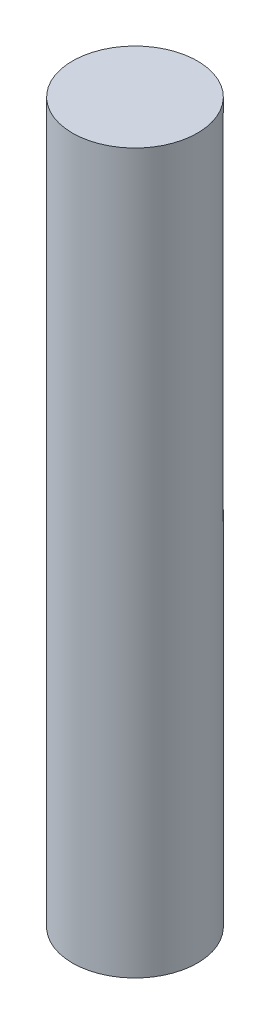
ISO-10303-21;
HEADER;
FILE_DESCRIPTION(('STEP AP214'),'2;1');
FILE_NAME('part.step','',(''),(''),'','','');
FILE_SCHEMA(('AUTOMOTIVE_DESIGN { 1 0 10303 214 1 1 1 1 }'));
ENDSEC;
DATA;
#1=APPLICATION_CONTEXT('core data for automotive mechanical design processes');
#2=APPLICATION_PROTOCOL_DEFINITION('international standard','automotive_design',2000,#1);
#3=PRODUCT_CONTEXT('',#1,'mechanical');
#4=PRODUCT('Part','Part','',(#3));
#5=PRODUCT_RELATED_PRODUCT_CATEGORY('part','',(#4));
#6=PRODUCT_DEFINITION_FORMATION('','',#4);
#7=PRODUCT_DEFINITION_CONTEXT('part definition',#1,'design');
#8=PRODUCT_DEFINITION('design','',#6,#7);
#9=PRODUCT_DEFINITION_SHAPE('','',#8);
#10=(LENGTH_UNIT() NAMED_UNIT(*) SI_UNIT(.MILLI.,.METRE.));
#11=(NAMED_UNIT(*) PLANE_ANGLE_UNIT() SI_UNIT($,.RADIAN.));
#12=(NAMED_UNIT(*) SI_UNIT($,.STERADIAN.) SOLID_ANGLE_UNIT());
#13=UNCERTAINTY_MEASURE_WITH_UNIT(LENGTH_MEASURE(1.E-05),#10,'distance_accuracy_value','');
#14=(GEOMETRIC_REPRESENTATION_CONTEXT(3) GLOBAL_UNCERTAINTY_ASSIGNED_CONTEXT((#13)) GLOBAL_UNIT_ASSIGNED_CONTEXT((#10,
#11,#12)) REPRESENTATION_CONTEXT('',''));
#15=CARTESIAN_POINT('',(0.,0.,0.));
#16=DIRECTION('',(0.,0.,1.));
#17=DIRECTION('',(1.,0.,0.));
#18=AXIS2_PLACEMENT_3D('',#15,#16,#17);
#19=CARTESIAN_POINT('',(0.,46.,0.));
#20=DIRECTION('',(0.,-1.,0.));
#21=DIRECTION('',(0.,0.,-1.));
#22=AXIS2_PLACEMENT_3D('',#19,#20,#21);
#23=CYLINDRICAL_SURFACE('',#22,8.);
#24=CARTESIAN_POINT('',(0.,46.,0.));
#25=DIRECTION('',(0.,1.,0.));
#26=DIRECTION('',(0.,0.,1.));
#27=AXIS2_PLACEMENT_3D('',#24,#25,#26);
#28=CIRCLE('',#27,8.);
#29=CARTESIAN_POINT('',(6.07947366142827,46.,-5.2));
#30=VERTEX_POINT('',#29);
#31=CARTESIAN_POINT('',(-6.07947366142827,46.,-5.2));
#32=VERTEX_POINT('',#31);
#33=EDGE_CURVE('E11',#30,#32,#28,.T.);
#34=ORIENTED_EDGE('',*,*,#33,.F.);
#35=DIRECTION('',(0.,-1.,0.));
#36=VECTOR('',#35,1.);
#37=CARTESIAN_POINT('',(6.07947366142827,90.,-5.2));
#38=LINE('',#37,#36);
#39=CARTESIAN_POINT('',(6.07947366142827,90.,-5.2));
#40=VERTEX_POINT('',#39);
#41=EDGE_CURVE('E71',#40,#30,#38,.T.);
#42=ORIENTED_EDGE('',*,*,#41,.F.);
#43=CARTESIAN_POINT('',(0.,90.,0.));
#44=DIRECTION('',(0.,1.,0.));
#45=DIRECTION('',(0.,0.,1.));
#46=AXIS2_PLACEMENT_3D('',#43,#44,#45);
#47=CIRCLE('',#46,8.);
#48=CARTESIAN_POINT('',(-6.07947366142827,90.,-5.2));
#49=VERTEX_POINT('',#48);
#50=EDGE_CURVE('E76',#40,#49,#47,.T.);
#51=ORIENTED_EDGE('',*,*,#50,.T.);
#52=DIRECTION('',(0.,-1.,0.));
#53=VECTOR('',#52,1.);
#54=CARTESIAN_POINT('',(-6.07947366142827,90.,-5.2));
#55=LINE('',#54,#53);
#56=EDGE_CURVE('E67',#49,#32,#55,.T.);
#57=ORIENTED_EDGE('',*,*,#56,.T.);
#58=EDGE_LOOP('',(#34,#42,#51,#57));
#59=FACE_BOUND('',#58,.T.);
#60=CARTESIAN_POINT('',(0.,0.,0.));
#61=DIRECTION('',(0.,1.,0.));
#62=DIRECTION('',(0.,0.,1.));
#63=AXIS2_PLACEMENT_3D('',#60,#61,#62);
#64=CIRCLE('',#63,8.);
#65=CARTESIAN_POINT('',(0.,0.,8.));
#66=VERTEX_POINT('',#65);
#67=EDGE_CURVE('E44',#66,#66,#64,.T.);
#68=ORIENTED_EDGE('',*,*,#67,.T.);
#69=EDGE_LOOP('',(#68));
#70=FACE_BOUND('',#69,.T.);
#71=CARTESIAN_POINT('',(0.,92.,0.));
#72=DIRECTION('',(0.,1.,0.));
#73=DIRECTION('',(0.,0.,1.));
#74=AXIS2_PLACEMENT_3D('',#71,#72,#73);
#75=CIRCLE('',#74,8.);
#76=CARTESIAN_POINT('',(0.,92.,8.));
#77=VERTEX_POINT('',#76);
#78=EDGE_CURVE('E79',#77,#77,#75,.T.);
#79=ORIENTED_EDGE('',*,*,#78,.F.);
#80=EDGE_LOOP('',(#79));
#81=FACE_BOUND('',#80,.T.);
#82=ADVANCED_FACE('F41',(#59,#70,#81),#23,.T.);
#83=CARTESIAN_POINT('',(0.,46.,0.));
#84=DIRECTION('',(0.,1.,0.));
#85=DIRECTION('',(0.,0.,1.));
#86=AXIS2_PLACEMENT_3D('',#83,#84,#85);
#87=PLANE('',#86);
#88=DIRECTION('',(-1.,0.,0.));
#89=VECTOR('',#88,1.);
#90=CARTESIAN_POINT('',(-6.07947366142827,46.,-5.2));
#91=LINE('',#90,#89);
#92=EDGE_CURVE('E53',#30,#32,#91,.T.);
#93=ORIENTED_EDGE('',*,*,#92,.F.);
#94=ORIENTED_EDGE('',*,*,#33,.T.);
#95=EDGE_LOOP('',(#93,#94));
#96=FACE_BOUND('',#95,.T.);
#97=ADVANCED_FACE('F91',(#96),#87,.T.);
#98=CARTESIAN_POINT('',(0.,0.,0.));
#99=DIRECTION('',(0.,1.,0.));
#100=DIRECTION('',(0.,0.,1.));
#101=AXIS2_PLACEMENT_3D('',#98,#99,#100);
#102=PLANE('',#101);
#103=ORIENTED_EDGE('',*,*,#67,.F.);
#104=EDGE_LOOP('',(#103));
#105=FACE_BOUND('',#104,.T.);
#106=ADVANCED_FACE('F89',(#105),#102,.F.);
#107=CARTESIAN_POINT('',(-6.07947366142827,90.,-5.2));
#108=DIRECTION('',(0.,0.,1.));
#109=DIRECTION('',(1.,0.,0.));
#110=AXIS2_PLACEMENT_3D('',#107,#108,#109);
#111=PLANE('',#110);
#112=ORIENTED_EDGE('',*,*,#92,.T.);
#113=ORIENTED_EDGE('',*,*,#56,.F.);
#114=DIRECTION('',(-1.,0.,0.));
#115=VECTOR('',#114,1.);
#116=CARTESIAN_POINT('',(-6.07947366142827,90.,-5.2));
#117=LINE('',#116,#115);
#118=EDGE_CURVE('E62',#40,#49,#117,.T.);
#119=ORIENTED_EDGE('',*,*,#118,.F.);
#120=ORIENTED_EDGE('',*,*,#41,.T.);
#121=EDGE_LOOP('',(#112,#113,#119,#120));
#122=FACE_BOUND('',#121,.T.);
#123=ADVANCED_FACE('F68',(#122),#111,.F.);
#124=CARTESIAN_POINT('',(0.,90.,0.));
#125=DIRECTION('',(0.,1.,0.));
#126=DIRECTION('',(0.,0.,1.));
#127=AXIS2_PLACEMENT_3D('',#124,#125,#126);
#128=PLANE('',#127);
#129=ORIENTED_EDGE('',*,*,#50,.F.);
#130=ORIENTED_EDGE('',*,*,#118,.T.);
#131=EDGE_LOOP('',(#129,#130));
#132=FACE_BOUND('',#131,.T.);
#133=ADVANCED_FACE('F75',(#132),#128,.F.);
#134=CARTESIAN_POINT('',(0.,92.,0.));
#135=DIRECTION('',(0.,1.,0.));
#136=DIRECTION('',(0.,0.,1.));
#137=AXIS2_PLACEMENT_3D('',#134,#135,#136);
#138=PLANE('',#137);
#139=ORIENTED_EDGE('',*,*,#78,.T.);
#140=EDGE_LOOP('',(#139));
#141=FACE_BOUND('',#140,.T.);
#142=ADVANCED_FACE('F115',(#141),#138,.T.);
#143=CLOSED_SHELL('',(#82,#97,#106,#123,#133,#142));
#144=MANIFOLD_SOLID_BREP('B2',#143);
#145=ADVANCED_BREP_SHAPE_REPRESENTATION('',(#18,#144),#14);
#146=SHAPE_DEFINITION_REPRESENTATION(#9,#145);
ENDSEC;
END-ISO-10303-21;
